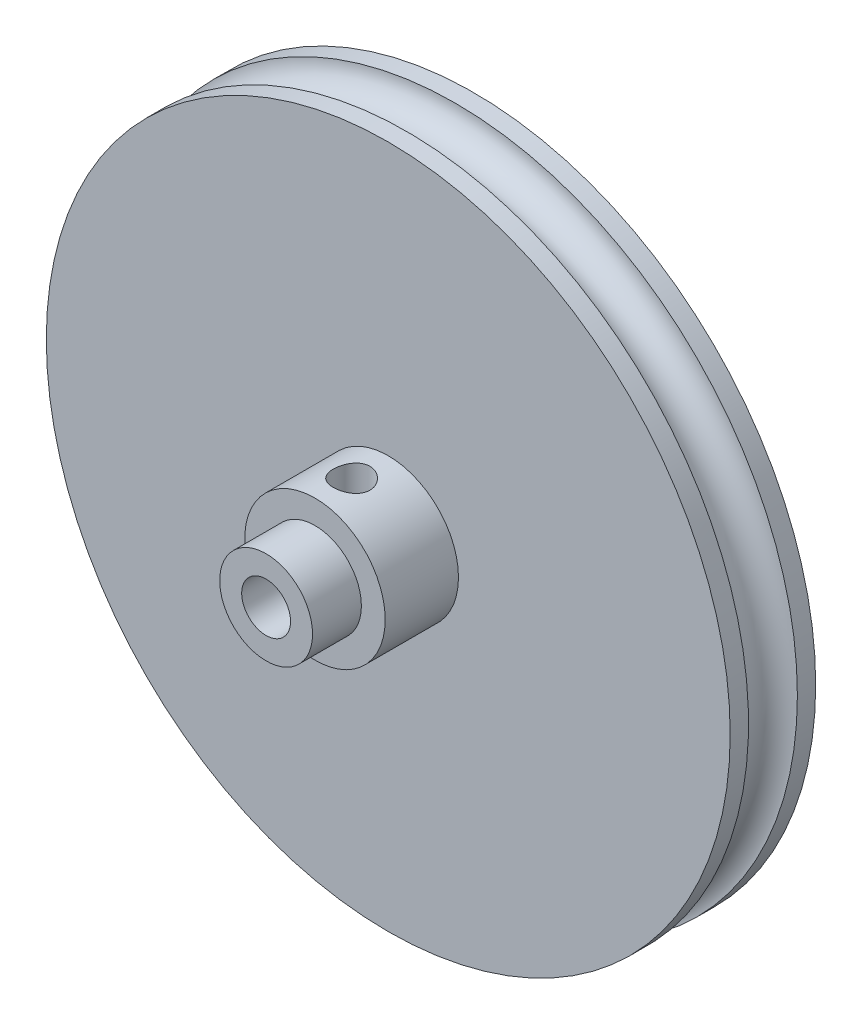
ISO-10303-21;
HEADER;
FILE_DESCRIPTION(('STEP AP214'),'2;1');
FILE_NAME('part.step','',(''),(''),'','','');
FILE_SCHEMA(('AUTOMOTIVE_DESIGN { 1 0 10303 214 1 1 1 1 }'));
ENDSEC;
DATA;
#1=APPLICATION_CONTEXT('core data for automotive mechanical design processes');
#2=APPLICATION_PROTOCOL_DEFINITION('international standard','automotive_design',2000,#1);
#3=PRODUCT_CONTEXT('',#1,'mechanical');
#4=PRODUCT('Part','Part','',(#3));
#5=PRODUCT_RELATED_PRODUCT_CATEGORY('part','',(#4));
#6=PRODUCT_DEFINITION_FORMATION('','',#4);
#7=PRODUCT_DEFINITION_CONTEXT('part definition',#1,'design');
#8=PRODUCT_DEFINITION('design','',#6,#7);
#9=PRODUCT_DEFINITION_SHAPE('','',#8);
#10=(LENGTH_UNIT() NAMED_UNIT(*) SI_UNIT(.MILLI.,.METRE.));
#11=(NAMED_UNIT(*) PLANE_ANGLE_UNIT() SI_UNIT($,.RADIAN.));
#12=(NAMED_UNIT(*) SI_UNIT($,.STERADIAN.) SOLID_ANGLE_UNIT());
#13=UNCERTAINTY_MEASURE_WITH_UNIT(LENGTH_MEASURE(1.E-05),#10,'distance_accuracy_value','');
#14=(GEOMETRIC_REPRESENTATION_CONTEXT(3) GLOBAL_UNCERTAINTY_ASSIGNED_CONTEXT((#13)) GLOBAL_UNIT_ASSIGNED_CONTEXT((#10,
#11,#12)) REPRESENTATION_CONTEXT('',''));
#15=CARTESIAN_POINT('',(0.,0.,0.));
#16=DIRECTION('',(0.,0.,1.));
#17=DIRECTION('',(1.,0.,0.));
#18=AXIS2_PLACEMENT_3D('',#15,#16,#17);
#19=CARTESIAN_POINT('',(0.,0.,0.));
#20=DIRECTION('',(0.,0.,1.));
#21=DIRECTION('',(1.,0.,0.));
#22=AXIS2_PLACEMENT_3D('',#19,#20,#21);
#23=CYLINDRICAL_SURFACE('',#22,2.);
#24=CARTESIAN_POINT('',(0.,0.,0.));
#25=DIRECTION('',(0.,0.,1.));
#26=DIRECTION('',(1.,0.,0.));
#27=AXIS2_PLACEMENT_3D('',#24,#25,#26);
#28=CIRCLE('',#27,2.);
#29=CARTESIAN_POINT('',(2.,0.,0.));
#30=VERTEX_POINT('',#29);
#31=EDGE_CURVE('E69',#30,#30,#28,.T.);
#32=ORIENTED_EDGE('',*,*,#31,.F.);
#33=EDGE_LOOP('',(#32));
#34=FACE_BOUND('',#33,.T.);
#35=CARTESIAN_POINT('',(0.,0.,17.));
#36=DIRECTION('',(0.,0.,1.));
#37=DIRECTION('',(1.,0.,0.));
#38=AXIS2_PLACEMENT_3D('',#35,#36,#37);
#39=CIRCLE('',#38,2.);
#40=CARTESIAN_POINT('',(2.,0.,17.));
#41=VERTEX_POINT('',#40);
#42=EDGE_CURVE('E57',#41,#41,#39,.T.);
#43=ORIENTED_EDGE('',*,*,#42,.T.);
#44=EDGE_LOOP('',(#43));
#45=FACE_BOUND('',#44,.T.);
#46=CARTESIAN_POINT('',(0.,2.,8.5));
#47=CARTESIAN_POINT('',(-0.0732207358411543,1.99999540196395,8.50000479201202));
#48=CARTESIAN_POINT('',(-0.146561062021485,1.99593645526274,8.5054050243745));
#49=CARTESIAN_POINT('',(-0.290936396286467,1.98006607281083,8.52666706341016));
#50=CARTESIAN_POINT('',(-0.361965136229004,1.96823514679854,8.54255517165006));
#51=CARTESIAN_POINT('',(-0.499234626631249,1.9379567495606,8.58371290928377));
#52=CARTESIAN_POINT('',(-0.565501615403736,1.91954951932009,8.60892551356918));
#53=CARTESIAN_POINT('',(-0.692422335520752,1.87750556721694,8.66754234418723));
#54=CARTESIAN_POINT('',(-0.753077701796332,1.85387037535483,8.70094417419352));
#55=CARTESIAN_POINT('',(-0.873465937590145,1.80049544543983,8.77826301159082));
#56=CARTESIAN_POINT('',(-0.932593229272032,1.77039308548439,8.82286732933407));
#57=CARTESIAN_POINT('',(-1.04302716767671,1.70767017883378,8.91949583736117));
#58=CARTESIAN_POINT('',(-1.09432148272226,1.67504578078609,8.97153148279983));
#59=CARTESIAN_POINT('',(-1.19837161436623,1.6027112365199,9.09358295327837));
#60=CARTESIAN_POINT('',(-1.24930578421204,1.56290854864639,9.1651036771217));
#61=CARTESIAN_POINT('',(-1.33861998176348,1.48711444664135,9.31745101236655));
#62=CARTESIAN_POINT('',(-1.37701716983077,1.45111786883675,9.39826469700031));
#63=CARTESIAN_POINT('',(-1.42880627811788,1.39977155180179,9.53950283867623));
#64=CARTESIAN_POINT('',(-1.44625674456539,1.38157751186733,9.59739069712838));
#65=CARTESIAN_POINT('',(-1.47420672564844,1.35171594150685,9.71639273478492));
#66=CARTESIAN_POINT('',(-1.48472215355267,1.34003347910832,9.77749917787479));
#67=CARTESIAN_POINT('',(-1.49812822141445,1.32503759684553,9.90218258553077));
#68=CARTESIAN_POINT('',(-1.50094954854207,1.32180026676597,9.96577680672405));
#69=CARTESIAN_POINT('',(-1.49848213241869,1.32459531776068,10.0926149108816));
#70=CARTESIAN_POINT('',(-1.49319048157349,1.33063102218113,10.1558586600874));
#71=CARTESIAN_POINT('',(-1.47597739291882,1.34967623262519,10.2731913474258));
#72=CARTESIAN_POINT('',(-1.46482486380817,1.36187157059871,10.3275363710462));
#73=CARTESIAN_POINT('',(-1.43705671120732,1.39114192844939,10.4334388787209));
#74=CARTESIAN_POINT('',(-1.42043583681172,1.40822163640769,10.4849936278236));
#75=CARTESIAN_POINT('',(-1.37033064172535,1.45741769294306,10.6162563866341));
#76=CARTESIAN_POINT('',(-1.3328014849398,1.49225649139233,10.6934004166435));
#77=CARTESIAN_POINT('',(-1.24618023314519,1.56533298145196,10.8391965238691));
#78=CARTESIAN_POINT('',(-1.19706004255878,1.60357878886109,10.9078273392547));
#79=CARTESIAN_POINT('',(-1.08651604102135,1.68051672313145,11.0377533904037));
#80=CARTESIAN_POINT('',(-1.02481375526037,1.71919586730239,11.0988206068815));
#81=CARTESIAN_POINT('',(-0.89042252170959,1.79248037980972,11.2102636467812));
#82=CARTESIAN_POINT('',(-0.817755054293757,1.8270934826376,11.2606599202304));
#83=CARTESIAN_POINT('',(-0.677902080454143,1.88279726073643,11.3399807992403));
#84=CARTESIAN_POINT('',(-0.61253987018562,1.90520770945008,11.3711845942158));
#85=CARTESIAN_POINT('',(-0.476352173202086,1.94372904416948,11.4242248804639));
#86=CARTESIAN_POINT('',(-0.405530141063766,1.95984387504352,11.4460672384993));
#87=CARTESIAN_POINT('',(-0.259676232483518,1.98445588635989,11.4792533628864));
#88=CARTESIAN_POINT('',(-0.184621281405943,1.99290592971749,11.4905321789386));
#89=CARTESIAN_POINT('',(-0.0332012397969171,2.00115883659445,11.5015495973717));
#90=CARTESIAN_POINT('',(0.0431632843727236,2.00096534845408,11.5012930686954));
#91=CARTESIAN_POINT('',(0.186804217329625,1.99242547175873,11.4898891307268));
#92=CARTESIAN_POINT('',(0.254222327546133,1.98490086600401,11.4798394631113));
#93=CARTESIAN_POINT('',(0.386110670609118,1.96351320201588,11.4510262199921));
#94=CARTESIAN_POINT('',(0.450580272987261,1.94964879507262,11.4322607903106));
#95=CARTESIAN_POINT('',(0.577416779689769,1.91599830683313,11.3861124694069));
#96=CARTESIAN_POINT('',(0.639629172536139,1.89602050290193,11.3584488185726));
#97=CARTESIAN_POINT('',(0.758518527043073,1.85166985411963,11.2958275445744));
#98=CARTESIAN_POINT('',(0.815194721336403,1.82729640132068,11.2608689123603));
#99=CARTESIAN_POINT('',(0.931511626319037,1.77119146886499,11.1782167535894));
#100=CARTESIAN_POINT('',(0.990066762698702,1.73891095025037,11.1293714605625));
#101=CARTESIAN_POINT('',(1.09871974855854,1.67238952874785,11.0239912474116));
#102=CARTESIAN_POINT('',(1.14879830469577,1.63814438507395,10.9674393003066));
#103=CARTESIAN_POINT('',(1.24877541075626,1.56369128291497,10.8358501190388));
#104=CARTESIAN_POINT('',(1.29683043648705,1.523587185201,10.7593424385077));
#105=CARTESIAN_POINT('',(1.37923235998283,1.4494059134845,10.5966399220275));
#106=CARTESIAN_POINT('',(1.41362000515519,1.41531099570969,10.5104748780914));
#107=CARTESIAN_POINT('',(1.45615734256767,1.37118877808583,10.3645855511255));
#108=CARTESIAN_POINT('',(1.46931009512996,1.35695811824565,10.3076088735976));
#109=CARTESIAN_POINT('',(1.48891522181906,1.33542056103011,10.1912929530168));
#110=CARTESIAN_POINT('',(1.4953825519924,1.32809821220233,10.1319592931977));
#111=CARTESIAN_POINT('',(1.50115320209064,1.32157601792209,10.0121709201887));
#112=CARTESIAN_POINT('',(1.50042015325262,1.32241740684975,9.95171205699043));
#113=CARTESIAN_POINT('',(1.49176883838219,1.33216448543666,9.83194316124784));
#114=CARTESIAN_POINT('',(1.48384130024585,1.34108058157484,9.77263471210274));
#115=CARTESIAN_POINT('',(1.45893841819723,1.36817348797773,9.6440854285892));
#116=CARTESIAN_POINT('',(1.44036567954111,1.38794705950643,9.57550281986723));
#117=CARTESIAN_POINT('',(1.39469627266119,1.4338296338541,9.44346515116952));
#118=CARTESIAN_POINT('',(1.3675780729773,1.4599546014693,9.38002355796181));
#119=CARTESIAN_POINT('',(1.29498918933643,1.52516477328824,9.23747936951367));
#120=CARTESIAN_POINT('',(1.2464154206597,1.56560203191105,9.16057841724425));
#121=CARTESIAN_POINT('',(1.13650718465936,1.64713510181273,9.01687395502244));
#122=CARTESIAN_POINT('',(1.07516134758577,1.68823146954222,8.95007953405516));
#123=CARTESIAN_POINT('',(0.939627144937894,1.76728988939793,8.82716815771667));
#124=CARTESIAN_POINT('',(0.865337161562862,1.80522333711072,8.77114368062281));
#125=CARTESIAN_POINT('',(0.705159098936206,1.87357289668097,8.67277694885465));
#126=CARTESIAN_POINT('',(0.619299420401797,1.90400691592959,8.63040202542749));
#127=CARTESIAN_POINT('',(0.464840290356458,1.94636704624048,8.57220057901429));
#128=CARTESIAN_POINT('',(0.398553614774736,1.96110322499718,8.55223326862383));
#129=CARTESIAN_POINT('',(0.262841610392764,1.98383739970238,8.52158209738851));
#130=CARTESIAN_POINT('',(0.19342562383491,1.99185421210894,8.51087230975004));
#131=CARTESIAN_POINT('',(0.102963309861892,1.99745471706309,8.50339530578565));
#132=CARTESIAN_POINT('',(0.0824069459941256,1.9984076143208,8.50212372251058));
#133=CARTESIAN_POINT('',(0.041236889624379,1.99968095423138,8.50042532676903));
#134=CARTESIAN_POINT('',(0.0206231884283885,2.00000129507253,8.49999865029263));
#135=CARTESIAN_POINT('',(0.,2.,8.5));
#136=B_SPLINE_CURVE_WITH_KNOTS('',3,(#46,#47,#48,#49,#50,#51,#52,#53,#54,#55,#56,#57,#58,#59,
#60,#61,#62,#63,#64,#65,#66,#67,#68,#69,#70,#71,#72,#73,#74,#75,#76,#77,#78,#79,#80,#81,#82,#83,
#84,#85,#86,#87,#88,#89,#90,#91,#92,#93,#94,#95,#96,#97,#98,#99,#100,#101,#102,#103,#104,#105,
#106,#107,#108,#109,#110,#111,#112,#113,#114,#115,#116,#117,#118,#119,#120,#121,#122,#123,#124,
#125,#126,#127,#128,#129,#130,#131,#132,#133,#134,#135),.UNSPECIFIED.,.T.,.F.,(4,2,2,2,2,2,2,2,
2,2,2,2,2,2,2,2,2,2,2,2,2,2,2,2,2,2,2,2,2,2,2,2,2,2,2,2,2,2,2,2,2,2,2,2,4),(0.,
0.219571786572042,0.439696319423244,0.658496333573381,0.877232398849292,1.1162243131743,
1.35558868405162,1.64360015887451,1.93121574056507,2.11999518529901,2.3083399319529,
2.49837587621257,2.6884799430021,2.85826890162709,3.0282213760064,3.3044933180591,
3.58144192357889,3.8653588393809,4.14872662493691,4.37526505006389,4.60166129643117,
4.82944058166899,5.05712372466613,5.26191187011994,5.46674360185812,5.6788043948368,
5.89089453977541,6.13840382081868,6.38646908985452,6.68168596015947,6.97601595850113,
7.15589161422933,7.33536399114209,7.51574333854741,7.69635548563854,7.91639670960134,
8.13699685139921,8.43412246655768,8.73151372390893,9.0313544949265,9.33047220273164,
9.5419569754163,9.75284752283256,9.81468166878711,9.87652576630966),.UNSPECIFIED.);
#137=CARTESIAN_POINT('',(0.,2.,8.5));
#138=VERTEX_POINT('',#137);
#139=EDGE_CURVE('E126',#138,#138,#136,.T.);
#140=ORIENTED_EDGE('',*,*,#139,.T.);
#141=EDGE_LOOP('',(#140));
#142=FACE_BOUND('',#141,.T.);
#143=ADVANCED_FACE('F34',(#34,#45,#142),#23,.F.);
#144=CARTESIAN_POINT('',(0.,0.,13.));
#145=DIRECTION('',(0.,0.,-1.));
#146=DIRECTION('',(-1.,0.,0.));
#147=AXIS2_PLACEMENT_3D('',#144,#145,#146);
#148=CYLINDRICAL_SURFACE('',#147,5.75);
#149=CARTESIAN_POINT('',(0.,0.,13.));
#150=DIRECTION('',(0.,0.,1.));
#151=DIRECTION('',(1.,0.,0.));
#152=AXIS2_PLACEMENT_3D('',#149,#150,#151);
#153=CIRCLE('',#152,5.75);
#154=CARTESIAN_POINT('',(5.75,0.,13.));
#155=VERTEX_POINT('',#154);
#156=EDGE_CURVE('E53',#155,#155,#153,.T.);
#157=ORIENTED_EDGE('',*,*,#156,.F.);
#158=EDGE_LOOP('',(#157));
#159=FACE_BOUND('',#158,.T.);
#160=CARTESIAN_POINT('',(0.,0.,7.));
#161=DIRECTION('',(0.,0.,1.));
#162=DIRECTION('',(1.,0.,0.));
#163=AXIS2_PLACEMENT_3D('',#160,#161,#162);
#164=CIRCLE('',#163,5.75);
#165=CARTESIAN_POINT('',(5.75,0.,7.));
#166=VERTEX_POINT('',#165);
#167=EDGE_CURVE('E59',#166,#166,#164,.T.);
#168=ORIENTED_EDGE('',*,*,#167,.T.);
#169=EDGE_LOOP('',(#168));
#170=FACE_BOUND('',#169,.T.);
#171=CARTESIAN_POINT('',(0.,5.75,8.5));
#172=CARTESIAN_POINT('',(0.0827565504301497,5.74999869210413,8.50000209693434));
#173=CARTESIAN_POINT('',(0.165535896333785,5.74819573678926,8.50687163655909));
#174=CARTESIAN_POINT('',(0.328714260063833,5.74117834518274,8.53412231590813));
#175=CARTESIAN_POINT('',(0.409112038400621,5.73596216398353,8.55451036662962));
#176=CARTESIAN_POINT('',(0.565147916645536,5.72269471803663,8.60809337090641));
#177=CARTESIAN_POINT('',(0.640791866299035,5.71464702139503,8.64127221128726));
#178=CARTESIAN_POINT('',(0.785441100183015,5.6965693697918,8.71943630696442));
#179=CARTESIAN_POINT('',(0.854446018094282,5.68653930554301,8.76442221322454));
#180=CARTESIAN_POINT('',(0.985395243676024,5.66533217333061,8.8659814469638));
#181=CARTESIAN_POINT('',(1.04717061891579,5.65413616833994,8.92276864635182));
#182=CARTESIAN_POINT('',(1.16043774099598,5.63198208961254,9.04586104532487));
#183=CARTESIAN_POINT('',(1.21192822336676,5.62102404527915,9.11216741351781));
#184=CARTESIAN_POINT('',(1.30397724199551,5.60039389168282,9.25375134761141));
#185=CARTESIAN_POINT('',(1.34434334141883,5.59074572831206,9.32915783233057));
#186=CARTESIAN_POINT('',(1.41175895890956,5.57410537320255,9.48597925944645));
#187=CARTESIAN_POINT('',(1.43881081557756,5.56711271508282,9.56739314377334));
#188=CARTESIAN_POINT('',(1.47824702752585,5.55677031015972,9.73205207693459));
#189=CARTESIAN_POINT('',(1.4909367764617,5.55334484273862,9.81521911320192));
#190=CARTESIAN_POINT('',(1.50224036987484,5.55029828055544,9.98256671426479));
#191=CARTESIAN_POINT('',(1.50085672263456,5.55067650786586,10.0667470957819));
#192=CARTESIAN_POINT('',(1.48429567965221,5.55512672552155,10.2313635488845));
#193=CARTESIAN_POINT('',(1.46948580722496,5.55910029308473,10.3118396759388));
#194=CARTESIAN_POINT('',(1.42708051177426,5.57013613953299,10.4691235497515));
#195=CARTESIAN_POINT('',(1.39948410614448,5.57719865579208,10.5459310140837));
#196=CARTESIAN_POINT('',(1.33198478786635,5.5937045163537,10.6946650061616));
#197=CARTESIAN_POINT('',(1.29195142735603,5.60317289375448,10.7665294381369));
#198=CARTESIAN_POINT('',(1.20080568188756,5.62340993425445,10.9026505986828));
#199=CARTESIAN_POINT('',(1.14969120122697,5.63417884314409,10.9669058846243));
#200=CARTESIAN_POINT('',(1.03594627958334,5.65621492770398,11.0880868684054));
#201=CARTESIAN_POINT('',(0.9730066664485,5.66748717408484,11.1447218365863));
#202=CARTESIAN_POINT('',(0.838386315191362,5.68895837312073,11.246691023225));
#203=CARTESIAN_POINT('',(0.766705261397836,5.69915728699075,11.2920248333949));
#204=CARTESIAN_POINT('',(0.616199144394334,5.71739102831751,11.3702252493992));
#205=CARTESIAN_POINT('',(0.537346599066203,5.72541701813719,11.4030411576181));
#206=CARTESIAN_POINT('',(0.374987203608011,5.73833660089413,11.4548683990326));
#207=CARTESIAN_POINT('',(0.291481329325966,5.74323084792075,11.473882614933));
#208=CARTESIAN_POINT('',(0.12466844814518,5.74923732985035,11.4971146775189));
#209=CARTESIAN_POINT('',(0.0414200784096534,5.75045062870886,11.5017280193963));
#210=CARTESIAN_POINT('',(-0.124660236000428,5.74924810980225,11.4971169376547));
#211=CARTESIAN_POINT('',(-0.207492220924062,5.74683264984631,11.4878938783566));
#212=CARTESIAN_POINT('',(-0.368990098986061,5.73870911781798,11.4561967953961));
#213=CARTESIAN_POINT('',(-0.447701939255478,5.73305546646209,11.4339416525768));
#214=CARTESIAN_POINT('',(-0.600268715228635,5.71909531448199,11.3770648411489));
#215=CARTESIAN_POINT('',(-0.674123135616293,5.71078853293703,11.3424418629537));
#216=CARTESIAN_POINT('',(-0.816428443616214,5.69220484598953,11.2610669954068));
#217=CARTESIAN_POINT('',(-0.884750411419281,5.68189358941189,11.2140976943347));
#218=CARTESIAN_POINT('',(-1.01268222253221,5.66049369913368,11.1096383923464));
#219=CARTESIAN_POINT('',(-1.07229041806259,5.64940491898805,11.0521464062013));
#220=CARTESIAN_POINT('',(-1.18275627994778,5.6273307326366,10.9264311721429));
#221=CARTESIAN_POINT('',(-1.23333544423787,5.61635612995624,10.8579608680037));
#222=CARTESIAN_POINT('',(-1.3222896776832,5.5960825093024,10.7132743901058));
#223=CARTESIAN_POINT('',(-1.36066527119569,5.58678341934373,10.6370585493393));
#224=CARTESIAN_POINT('',(-1.42383428632845,5.57101932883981,10.4794370807867));
#225=CARTESIAN_POINT('',(-1.44870733752349,5.5645377585197,10.398065111417));
#226=CARTESIAN_POINT('',(-1.48436197994454,5.55513419747947,10.2320970746916));
#227=CARTESIAN_POINT('',(-1.49514698498135,5.5522113444238,10.1475017935233));
#228=CARTESIAN_POINT('',(-1.50212929714525,5.55032597891716,9.98033352927471));
#229=CARTESIAN_POINT('',(-1.49877331702716,5.55124218564566,9.89778028650471));
#230=CARTESIAN_POINT('',(-1.47860023277945,5.55664900804772,9.7344606280366));
#231=CARTESIAN_POINT('',(-1.46178344725374,5.56113953912056,9.65369417009355));
#232=CARTESIAN_POINT('',(-1.41541989316566,5.57311845404139,9.49677581677364));
#233=CARTESIAN_POINT('',(-1.38596393084726,5.58058542694998,9.42059534300181));
#234=CARTESIAN_POINT('',(-1.31522905504201,5.59767724921601,9.27420105076281));
#235=CARTESIAN_POINT('',(-1.273948361164,5.6073024234757,9.20398813286678));
#236=CARTESIAN_POINT('',(-1.17936548934914,5.62796582443248,9.06938035166689));
#237=CARTESIAN_POINT('',(-1.12575664428232,5.63903628879905,9.00520588752847));
#238=CARTESIAN_POINT('',(-1.00862756716089,5.66115857831811,8.88661858880262));
#239=CARTESIAN_POINT('',(-0.94510495002805,5.67221039833667,8.83220811004711));
#240=CARTESIAN_POINT('',(-0.808402581432237,5.69331699830976,8.7336156116059));
#241=CARTESIAN_POINT('',(-0.735053640266801,5.70334712127171,8.68966247041353));
#242=CARTESIAN_POINT('',(-0.581750060014079,5.72101404443558,8.61478043939368));
#243=CARTESIAN_POINT('',(-0.50179987983651,5.72865244372007,8.58384284272776));
#244=CARTESIAN_POINT('',(-0.351741777794353,5.73963699654114,8.54010420641963));
#245=CARTESIAN_POINT('',(-0.282305646729965,5.74349538660568,8.52509918594351));
#246=CARTESIAN_POINT('',(-0.141918507101204,5.74867733519136,8.50504663119056));
#247=CARTESIAN_POINT('',(-0.0709676352972892,5.75000112158224,8.49999820178015));
#248=CARTESIAN_POINT('',(0.,5.75,8.5));
#249=B_SPLINE_CURVE_WITH_KNOTS('',3,(#171,#172,#173,#174,#175,#176,#177,#178,#179,#180,#181,
#182,#183,#184,#185,#186,#187,#188,#189,#190,#191,#192,#193,#194,#195,#196,#197,#198,#199,#200,
#201,#202,#203,#204,#205,#206,#207,#208,#209,#210,#211,#212,#213,#214,#215,#216,#217,#218,#219,
#220,#221,#222,#223,#224,#225,#226,#227,#228,#229,#230,#231,#232,#233,#234,#235,#236,#237,#238,
#239,#240,#241,#242,#243,#244,#245,#246,#247,#248),.UNSPECIFIED.,.T.,.F.,(4,2,2,2,2,2,2,2,2,2,2,
2,2,2,2,2,2,2,2,2,2,2,2,2,2,2,2,2,2,2,2,2,2,2,2,2,2,2,4),(0.,0.248009461318893,
0.496145809063828,0.743970583594285,0.991809024421142,1.24460721819603,1.49743647298028,
1.75439818241906,2.01131474130253,2.26265911775352,2.51395869822046,2.75858040416548,
3.00322091166615,3.25051934152511,3.49786458224273,3.7529160379782,4.00797670687022,
4.26405967513086,4.520089140957,4.76902239537675,5.01793110565878,5.2627745289135,
5.50764388546504,5.75715356277692,6.00671036165089,6.26297981565022,6.51923825689677,
6.7739685583984,7.02863712227793,7.27532204322615,7.52200112555968,7.76693685868474,
8.01190948996992,8.26380271891957,8.5157566426103,8.7728012919595,9.02967371503768,
9.24237261906137,9.45505239981192),.UNSPECIFIED.);
#250=CARTESIAN_POINT('',(0.,5.75,8.5));
#251=VERTEX_POINT('',#250);
#252=EDGE_CURVE('E122',#251,#251,#249,.T.);
#253=ORIENTED_EDGE('',*,*,#252,.T.);
#254=EDGE_LOOP('',(#253));
#255=FACE_BOUND('',#254,.T.);
#256=ADVANCED_FACE('F96',(#159,#170,#255),#148,.T.);
#257=CARTESIAN_POINT('',(0.,0.,7.));
#258=DIRECTION('',(0.,0.,1.));
#259=DIRECTION('',(1.,0.,0.));
#260=AXIS2_PLACEMENT_3D('',#257,#258,#259);
#261=PLANE('',#260);
#262=CARTESIAN_POINT('',(0.,0.,7.));
#263=DIRECTION('',(0.,0.,1.));
#264=DIRECTION('',(1.,0.,0.));
#265=AXIS2_PLACEMENT_3D('',#262,#263,#264);
#266=CIRCLE('',#265,28.);
#267=CARTESIAN_POINT('',(28.,0.,7.));
#268=VERTEX_POINT('',#267);
#269=EDGE_CURVE('E10',#268,#268,#266,.T.);
#270=ORIENTED_EDGE('',*,*,#269,.T.);
#271=EDGE_LOOP('',(#270));
#272=FACE_BOUND('',#271,.T.);
#273=ORIENTED_EDGE('',*,*,#167,.F.);
#274=EDGE_LOOP('',(#273));
#275=FACE_BOUND('',#274,.T.);
#276=ADVANCED_FACE('F102',(#272,#275),#261,.T.);
#277=CARTESIAN_POINT('',(0.,0.,7.));
#278=DIRECTION('',(0.,0.,-1.));
#279=DIRECTION('',(-1.,0.,0.));
#280=AXIS2_PLACEMENT_3D('',#277,#278,#279);
#281=CYLINDRICAL_SURFACE('',#280,28.);
#282=CARTESIAN_POINT('',(0.,0.,1.5));
#283=DIRECTION('',(0.,0.,1.));
#284=DIRECTION('',(1.,0.,0.));
#285=AXIS2_PLACEMENT_3D('',#282,#283,#284);
#286=CIRCLE('',#285,28.);
#287=CARTESIAN_POINT('',(28.,0.,1.5));
#288=VERTEX_POINT('',#287);
#289=EDGE_CURVE('E38',#288,#288,#286,.F.);
#290=ORIENTED_EDGE('',*,*,#289,.T.);
#291=EDGE_LOOP('',(#290));
#292=FACE_BOUND('',#291,.T.);
#293=CARTESIAN_POINT('',(0.,0.,0.));
#294=DIRECTION('',(0.,0.,1.));
#295=DIRECTION('',(1.,0.,0.));
#296=AXIS2_PLACEMENT_3D('',#293,#294,#295);
#297=CIRCLE('',#296,28.);
#298=CARTESIAN_POINT('',(28.,0.,0.));
#299=VERTEX_POINT('',#298);
#300=EDGE_CURVE('E42',#299,#299,#297,.T.);
#301=ORIENTED_EDGE('',*,*,#300,.T.);
#302=EDGE_LOOP('',(#301));
#303=FACE_BOUND('',#302,.T.);
#304=ADVANCED_FACE('F166',(#292,#303),#281,.T.);
#305=CARTESIAN_POINT('',(0.,0.,5.5));
#306=DIRECTION('',(0.,0.,-1.));
#307=DIRECTION('',(-1.,0.,0.));
#308=AXIS2_PLACEMENT_3D('',#305,#306,#307);
#309=CIRCLE('',#308,28.);
#310=CARTESIAN_POINT('',(-28.,0.,5.5));
#311=VERTEX_POINT('',#310);
#312=EDGE_CURVE('E51',#311,#311,#309,.F.);
#313=ORIENTED_EDGE('',*,*,#312,.T.);
#314=EDGE_LOOP('',(#313));
#315=FACE_BOUND('',#314,.T.);
#316=ORIENTED_EDGE('',*,*,#269,.F.);
#317=EDGE_LOOP('',(#316));
#318=FACE_BOUND('',#317,.T.);
#319=ADVANCED_FACE('F36',(#315,#318),#281,.T.);
#320=CARTESIAN_POINT('',(0.,0.,0.));
#321=DIRECTION('',(0.,0.,1.));
#322=DIRECTION('',(1.,0.,0.));
#323=AXIS2_PLACEMENT_3D('',#320,#321,#322);
#324=PLANE('',#323);
#325=ORIENTED_EDGE('',*,*,#31,.T.);
#326=EDGE_LOOP('',(#325));
#327=FACE_BOUND('',#326,.T.);
#328=ORIENTED_EDGE('',*,*,#300,.F.);
#329=EDGE_LOOP('',(#328));
#330=FACE_BOUND('',#329,.T.);
#331=ADVANCED_FACE('F86',(#327,#330),#324,.F.);
#332=CARTESIAN_POINT('',(0.,0.,17.));
#333=DIRECTION('',(0.,0.,-1.));
#334=DIRECTION('',(-1.,0.,0.));
#335=AXIS2_PLACEMENT_3D('',#332,#333,#334);
#336=CYLINDRICAL_SURFACE('',#335,3.8);
#337=CARTESIAN_POINT('',(0.,0.,13.));
#338=DIRECTION('',(0.,0.,1.));
#339=DIRECTION('',(1.,0.,0.));
#340=AXIS2_PLACEMENT_3D('',#337,#338,#339);
#341=CIRCLE('',#340,3.8);
#342=CARTESIAN_POINT('',(3.8,0.,13.));
#343=VERTEX_POINT('',#342);
#344=EDGE_CURVE('E64',#343,#343,#341,.T.);
#345=ORIENTED_EDGE('',*,*,#344,.T.);
#346=EDGE_LOOP('',(#345));
#347=FACE_BOUND('',#346,.T.);
#348=CARTESIAN_POINT('',(0.,0.,17.));
#349=DIRECTION('',(0.,0.,1.));
#350=DIRECTION('',(1.,0.,0.));
#351=AXIS2_PLACEMENT_3D('',#348,#349,#350);
#352=CIRCLE('',#351,3.8);
#353=CARTESIAN_POINT('',(3.8,0.,17.));
#354=VERTEX_POINT('',#353);
#355=EDGE_CURVE('E47',#354,#354,#352,.T.);
#356=ORIENTED_EDGE('',*,*,#355,.F.);
#357=EDGE_LOOP('',(#356));
#358=FACE_BOUND('',#357,.T.);
#359=ADVANCED_FACE('F80',(#347,#358),#336,.T.);
#360=CARTESIAN_POINT('',(0.,0.,17.));
#361=DIRECTION('',(0.,0.,1.));
#362=DIRECTION('',(1.,0.,0.));
#363=AXIS2_PLACEMENT_3D('',#360,#361,#362);
#364=PLANE('',#363);
#365=ORIENTED_EDGE('',*,*,#42,.F.);
#366=EDGE_LOOP('',(#365));
#367=FACE_BOUND('',#366,.T.);
#368=ORIENTED_EDGE('',*,*,#355,.T.);
#369=EDGE_LOOP('',(#368));
#370=FACE_BOUND('',#369,.T.);
#371=ADVANCED_FACE('F76',(#367,#370),#364,.T.);
#372=CARTESIAN_POINT('',(0.,0.,3.5));
#373=DIRECTION('',(0.,0.,-1.));
#374=DIRECTION('',(-1.,0.,0.));
#375=AXIS2_PLACEMENT_3D('',#372,#373,#374);
#376=TOROIDAL_SURFACE('',#375,28.,2.);
#377=ORIENTED_EDGE('',*,*,#312,.F.);
#378=EDGE_LOOP('',(#377));
#379=FACE_BOUND('',#378,.T.);
#380=ORIENTED_EDGE('',*,*,#289,.F.);
#381=EDGE_LOOP('',(#380));
#382=FACE_BOUND('',#381,.T.);
#383=ADVANCED_FACE('F79',(#379,#382),#376,.F.);
#384=CARTESIAN_POINT('',(0.,0.,13.));
#385=DIRECTION('',(0.,0.,1.));
#386=DIRECTION('',(1.,0.,0.));
#387=AXIS2_PLACEMENT_3D('',#384,#385,#386);
#388=PLANE('',#387);
#389=ORIENTED_EDGE('',*,*,#156,.T.);
#390=EDGE_LOOP('',(#389));
#391=FACE_BOUND('',#390,.T.);
#392=ORIENTED_EDGE('',*,*,#344,.F.);
#393=EDGE_LOOP('',(#392));
#394=FACE_BOUND('',#393,.T.);
#395=ADVANCED_FACE('F108',(#391,#394),#388,.T.);
#396=CARTESIAN_POINT('',(0.,28.001,10.));
#397=DIRECTION('',(0.,-1.,0.));
#398=DIRECTION('',(0.,0.,-1.));
#399=AXIS2_PLACEMENT_3D('',#396,#397,#398);
#400=CYLINDRICAL_SURFACE('',#399,1.5);
#401=ORIENTED_EDGE('',*,*,#252,.F.);
#402=EDGE_LOOP('',(#401));
#403=FACE_BOUND('',#402,.T.);
#404=ORIENTED_EDGE('',*,*,#139,.F.);
#405=EDGE_LOOP('',(#404));
#406=FACE_BOUND('',#405,.T.);
#407=ADVANCED_FACE('F113',(#403,#406),#400,.F.);
#408=CLOSED_SHELL('',(#143,#256,#276,#304,#319,#331,#359,#371,#383,#395,#407));
#409=MANIFOLD_SOLID_BREP('B2',#408);
#410=ADVANCED_BREP_SHAPE_REPRESENTATION('',(#18,#409),#14);
#411=SHAPE_DEFINITION_REPRESENTATION(#9,#410);
ENDSEC;
END-ISO-10303-21;
